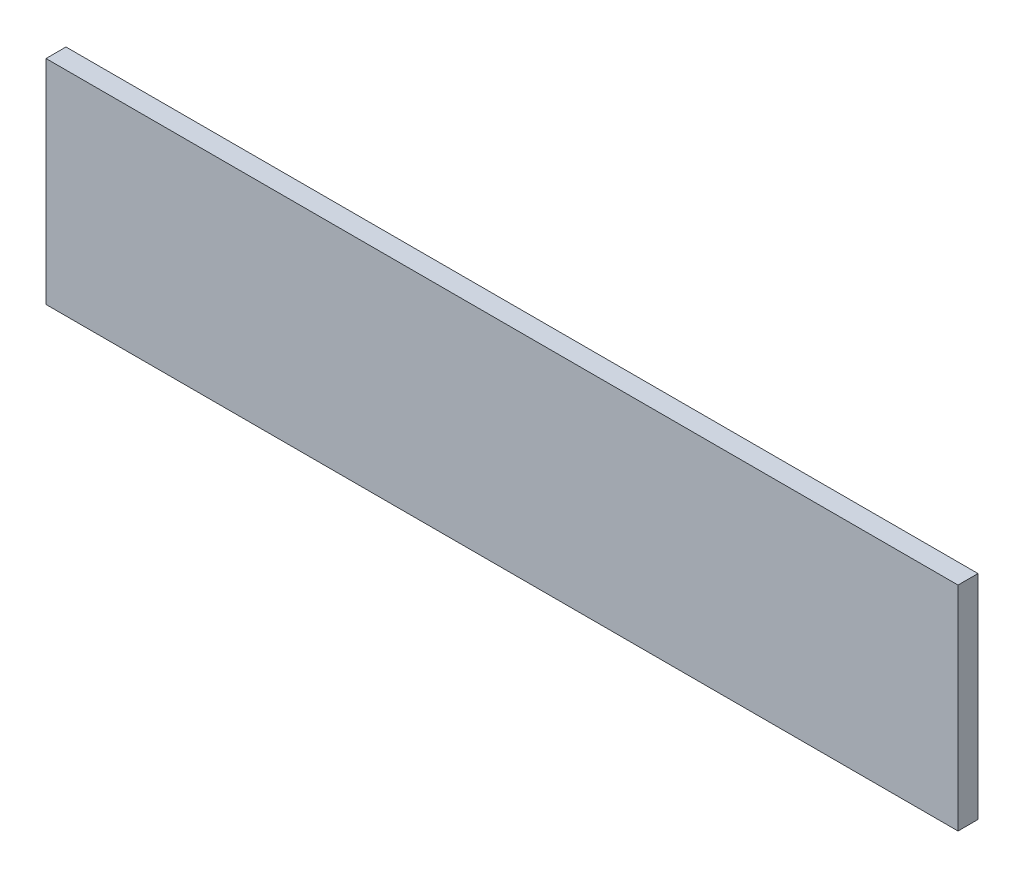
ISO-10303-21;
HEADER;
FILE_DESCRIPTION(('STEP AP214'),'2;1');
FILE_NAME('part.step','',(''),(''),'','','');
FILE_SCHEMA(('AUTOMOTIVE_DESIGN { 1 0 10303 214 1 1 1 1 }'));
ENDSEC;
DATA;
#1=APPLICATION_CONTEXT('core data for automotive mechanical design processes');
#2=APPLICATION_PROTOCOL_DEFINITION('international standard','automotive_design',2000,#1);
#3=PRODUCT_CONTEXT('',#1,'mechanical');
#4=PRODUCT('Part','Part','',(#3));
#5=PRODUCT_RELATED_PRODUCT_CATEGORY('part','',(#4));
#6=PRODUCT_DEFINITION_FORMATION('','',#4);
#7=PRODUCT_DEFINITION_CONTEXT('part definition',#1,'design');
#8=PRODUCT_DEFINITION('design','',#6,#7);
#9=PRODUCT_DEFINITION_SHAPE('','',#8);
#10=(LENGTH_UNIT() NAMED_UNIT(*) SI_UNIT(.MILLI.,.METRE.));
#11=(NAMED_UNIT(*) PLANE_ANGLE_UNIT() SI_UNIT($,.RADIAN.));
#12=(NAMED_UNIT(*) SI_UNIT($,.STERADIAN.) SOLID_ANGLE_UNIT());
#13=UNCERTAINTY_MEASURE_WITH_UNIT(LENGTH_MEASURE(1.E-05),#10,'distance_accuracy_value','');
#14=(GEOMETRIC_REPRESENTATION_CONTEXT(3) GLOBAL_UNCERTAINTY_ASSIGNED_CONTEXT((#13)) GLOBAL_UNIT_ASSIGNED_CONTEXT((#10,
#11,#12)) REPRESENTATION_CONTEXT('',''));
#15=CARTESIAN_POINT('',(0.,0.,0.));
#16=DIRECTION('',(0.,0.,1.));
#17=DIRECTION('',(1.,0.,0.));
#18=AXIS2_PLACEMENT_3D('',#15,#16,#17);
#19=CARTESIAN_POINT('',(434.975,-101.6,19.05));
#20=DIRECTION('',(-1.,0.,0.));
#21=DIRECTION('',(0.,0.,1.));
#22=AXIS2_PLACEMENT_3D('',#19,#20,#21);
#23=PLANE('',#22);
#24=DIRECTION('',(0.,1.,0.));
#25=VECTOR('',#24,1.);
#26=CARTESIAN_POINT('',(434.975,-101.6,0.));
#27=LINE('',#26,#25);
#28=CARTESIAN_POINT('',(434.975,-101.6,0.));
#29=VERTEX_POINT('',#28);
#30=CARTESIAN_POINT('',(434.975,101.6,0.));
#31=VERTEX_POINT('',#30);
#32=EDGE_CURVE('E99',#29,#31,#27,.T.);
#33=ORIENTED_EDGE('',*,*,#32,.T.);
#34=DIRECTION('',(0.,0.,-1.));
#35=VECTOR('',#34,1.);
#36=CARTESIAN_POINT('',(434.975,101.6,19.05));
#37=LINE('',#36,#35);
#38=CARTESIAN_POINT('',(434.975,101.6,19.05));
#39=VERTEX_POINT('',#38);
#40=EDGE_CURVE('E11',#39,#31,#37,.T.);
#41=ORIENTED_EDGE('',*,*,#40,.F.);
#42=DIRECTION('',(0.,1.,0.));
#43=VECTOR('',#42,1.);
#44=CARTESIAN_POINT('',(434.975,-101.6,19.05));
#45=LINE('',#44,#43);
#46=CARTESIAN_POINT('',(434.975,-101.6,19.05));
#47=VERTEX_POINT('',#46);
#48=EDGE_CURVE('E87',#47,#39,#45,.T.);
#49=ORIENTED_EDGE('',*,*,#48,.F.);
#50=DIRECTION('',(0.,0.,-1.));
#51=VECTOR('',#50,1.);
#52=CARTESIAN_POINT('',(434.975,-101.6,19.05));
#53=LINE('',#52,#51);
#54=EDGE_CURVE('E95',#47,#29,#53,.T.);
#55=ORIENTED_EDGE('',*,*,#54,.T.);
#56=EDGE_LOOP('',(#33,#41,#49,#55));
#57=FACE_BOUND('',#56,.T.);
#58=ADVANCED_FACE('F36',(#57),#23,.F.);
#59=CARTESIAN_POINT('',(-434.975,101.6,19.05));
#60=DIRECTION('',(0.,-1.,0.));
#61=DIRECTION('',(0.,0.,-1.));
#62=AXIS2_PLACEMENT_3D('',#59,#60,#61);
#63=PLANE('',#62);
#64=DIRECTION('',(-1.,0.,0.));
#65=VECTOR('',#64,1.);
#66=CARTESIAN_POINT('',(-434.975,101.6,0.));
#67=LINE('',#66,#65);
#68=CARTESIAN_POINT('',(-434.975,101.6,0.));
#69=VERTEX_POINT('',#68);
#70=EDGE_CURVE('E91',#31,#69,#67,.T.);
#71=ORIENTED_EDGE('',*,*,#70,.T.);
#72=DIRECTION('',(0.,0.,-1.));
#73=VECTOR('',#72,1.);
#74=CARTESIAN_POINT('',(-434.975,101.6,19.05));
#75=LINE('',#74,#73);
#76=CARTESIAN_POINT('',(-434.975,101.6,19.05));
#77=VERTEX_POINT('',#76);
#78=EDGE_CURVE('E44',#77,#69,#75,.T.);
#79=ORIENTED_EDGE('',*,*,#78,.F.);
#80=DIRECTION('',(-1.,0.,0.));
#81=VECTOR('',#80,1.);
#82=CARTESIAN_POINT('',(-434.975,101.6,19.05));
#83=LINE('',#82,#81);
#84=EDGE_CURVE('E82',#39,#77,#83,.T.);
#85=ORIENTED_EDGE('',*,*,#84,.F.);
#86=ORIENTED_EDGE('',*,*,#40,.T.);
#87=EDGE_LOOP('',(#71,#79,#85,#86));
#88=FACE_BOUND('',#87,.T.);
#89=ADVANCED_FACE('F90',(#88),#63,.F.);
#90=CARTESIAN_POINT('',(-434.975,-101.6,19.05));
#91=DIRECTION('',(1.,0.,0.));
#92=DIRECTION('',(0.,0.,-1.));
#93=AXIS2_PLACEMENT_3D('',#90,#91,#92);
#94=PLANE('',#93);
#95=DIRECTION('',(0.,-1.,0.));
#96=VECTOR('',#95,1.);
#97=CARTESIAN_POINT('',(-434.975,-101.6,0.));
#98=LINE('',#97,#96);
#99=CARTESIAN_POINT('',(-434.975,-101.6,0.));
#100=VERTEX_POINT('',#99);
#101=EDGE_CURVE('E69',#69,#100,#98,.T.);
#102=ORIENTED_EDGE('',*,*,#101,.T.);
#103=DIRECTION('',(0.,0.,-1.));
#104=VECTOR('',#103,1.);
#105=CARTESIAN_POINT('',(-434.975,-101.6,19.05));
#106=LINE('',#105,#104);
#107=CARTESIAN_POINT('',(-434.975,-101.6,19.05));
#108=VERTEX_POINT('',#107);
#109=EDGE_CURVE('E92',#108,#100,#106,.T.);
#110=ORIENTED_EDGE('',*,*,#109,.F.);
#111=DIRECTION('',(0.,-1.,0.));
#112=VECTOR('',#111,1.);
#113=CARTESIAN_POINT('',(-434.975,-101.6,19.05));
#114=LINE('',#113,#112);
#115=EDGE_CURVE('E85',#77,#108,#114,.T.);
#116=ORIENTED_EDGE('',*,*,#115,.F.);
#117=ORIENTED_EDGE('',*,*,#78,.T.);
#118=EDGE_LOOP('',(#102,#110,#116,#117));
#119=FACE_BOUND('',#118,.T.);
#120=ADVANCED_FACE('F93',(#119),#94,.F.);
#121=CARTESIAN_POINT('',(-434.975,-101.6,19.05));
#122=DIRECTION('',(0.,1.,0.));
#123=DIRECTION('',(0.,0.,1.));
#124=AXIS2_PLACEMENT_3D('',#121,#122,#123);
#125=PLANE('',#124);
#126=DIRECTION('',(1.,0.,0.));
#127=VECTOR('',#126,1.);
#128=CARTESIAN_POINT('',(-434.975,-101.6,0.));
#129=LINE('',#128,#127);
#130=EDGE_CURVE('E75',#100,#29,#129,.T.);
#131=ORIENTED_EDGE('',*,*,#130,.T.);
#132=ORIENTED_EDGE('',*,*,#54,.F.);
#133=DIRECTION('',(1.,0.,0.));
#134=VECTOR('',#133,1.);
#135=CARTESIAN_POINT('',(-434.975,-101.6,19.05));
#136=LINE('',#135,#134);
#137=EDGE_CURVE('E52',#108,#47,#136,.T.);
#138=ORIENTED_EDGE('',*,*,#137,.F.);
#139=ORIENTED_EDGE('',*,*,#109,.T.);
#140=EDGE_LOOP('',(#131,#132,#138,#139));
#141=FACE_BOUND('',#140,.T.);
#142=ADVANCED_FACE('F106',(#141),#125,.F.);
#143=CARTESIAN_POINT('',(0.,0.,19.05));
#144=DIRECTION('',(0.,0.,-1.));
#145=DIRECTION('',(-1.,0.,0.));
#146=AXIS2_PLACEMENT_3D('',#143,#144,#145);
#147=PLANE('',#146);
#148=ORIENTED_EDGE('',*,*,#48,.T.);
#149=ORIENTED_EDGE('',*,*,#84,.T.);
#150=ORIENTED_EDGE('',*,*,#115,.T.);
#151=ORIENTED_EDGE('',*,*,#137,.T.);
#152=EDGE_LOOP('',(#148,#149,#150,#151));
#153=FACE_BOUND('',#152,.T.);
#154=ADVANCED_FACE('F83',(#153),#147,.F.);
#155=CARTESIAN_POINT('',(0.,0.,0.));
#156=DIRECTION('',(0.,0.,-1.));
#157=DIRECTION('',(-1.,0.,0.));
#158=AXIS2_PLACEMENT_3D('',#155,#156,#157);
#159=PLANE('',#158);
#160=ORIENTED_EDGE('',*,*,#32,.F.);
#161=ORIENTED_EDGE('',*,*,#130,.F.);
#162=ORIENTED_EDGE('',*,*,#101,.F.);
#163=ORIENTED_EDGE('',*,*,#70,.F.);
#164=EDGE_LOOP('',(#160,#161,#162,#163));
#165=FACE_BOUND('',#164,.T.);
#166=ADVANCED_FACE('F109',(#165),#159,.T.);
#167=CLOSED_SHELL('',(#58,#89,#120,#142,#154,#166));
#168=MANIFOLD_SOLID_BREP('B2',#167);
#169=ADVANCED_BREP_SHAPE_REPRESENTATION('',(#18,#168),#14);
#170=SHAPE_DEFINITION_REPRESENTATION(#9,#169);
ENDSEC;
END-ISO-10303-21;
